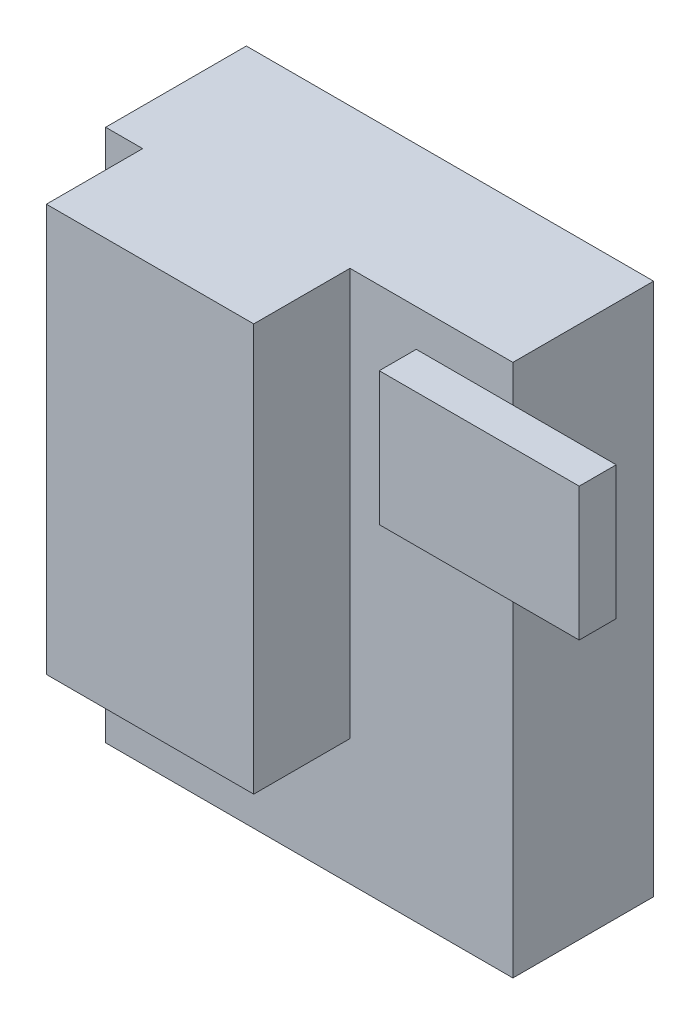
ISO-10303-21;
HEADER;
FILE_DESCRIPTION(('STEP AP214'),'2;1');
FILE_NAME('part.step','',(''),(''),'','','');
FILE_SCHEMA(('AUTOMOTIVE_DESIGN { 1 0 10303 214 1 1 1 1 }'));
ENDSEC;
DATA;
#1=APPLICATION_CONTEXT('core data for automotive mechanical design processes');
#2=APPLICATION_PROTOCOL_DEFINITION('international standard','automotive_design',2000,#1);
#3=PRODUCT_CONTEXT('',#1,'mechanical');
#4=PRODUCT('Part','Part','',(#3));
#5=PRODUCT_RELATED_PRODUCT_CATEGORY('part','',(#4));
#6=PRODUCT_DEFINITION_FORMATION('','',#4);
#7=PRODUCT_DEFINITION_CONTEXT('part definition',#1,'design');
#8=PRODUCT_DEFINITION('design','',#6,#7);
#9=PRODUCT_DEFINITION_SHAPE('','',#8);
#10=(LENGTH_UNIT() NAMED_UNIT(*) SI_UNIT(.MILLI.,.METRE.));
#11=(NAMED_UNIT(*) PLANE_ANGLE_UNIT() SI_UNIT($,.RADIAN.));
#12=(NAMED_UNIT(*) SI_UNIT($,.STERADIAN.) SOLID_ANGLE_UNIT());
#13=UNCERTAINTY_MEASURE_WITH_UNIT(LENGTH_MEASURE(1.E-05),#10,'distance_accuracy_value','');
#14=(GEOMETRIC_REPRESENTATION_CONTEXT(3) GLOBAL_UNCERTAINTY_ASSIGNED_CONTEXT((#13)) GLOBAL_UNIT_ASSIGNED_CONTEXT((#10,
#11,#12)) REPRESENTATION_CONTEXT('',''));
#15=CARTESIAN_POINT('',(0.,0.,0.));
#16=DIRECTION('',(0.,0.,1.));
#17=DIRECTION('',(1.,0.,0.));
#18=AXIS2_PLACEMENT_3D('',#15,#16,#17);
#19=CARTESIAN_POINT('',(0.,0.,19.));
#20=DIRECTION('',(0.,0.,1.));
#21=DIRECTION('',(1.,0.,0.));
#22=AXIS2_PLACEMENT_3D('',#19,#20,#21);
#23=PLANE('',#22);
#24=DIRECTION('',(0.,1.,0.));
#25=VECTOR('',#24,1.);
#26=CARTESIAN_POINT('',(27.7547837249418,20.2890365448505,19.));
#27=LINE('',#26,#25);
#28=CARTESIAN_POINT('',(27.7547837249418,-51.7109634551495,19.));
#29=VERTEX_POINT('',#28);
#30=CARTESIAN_POINT('',(27.7547837249418,-2.7109634551495,19.));
#31=VERTEX_POINT('',#30);
#32=EDGE_CURVE('E194',#29,#31,#27,.T.);
#33=ORIENTED_EDGE('',*,*,#32,.T.);
#34=DIRECTION('',(1.,0.,0.));
#35=VECTOR('',#34,1.);
#36=CARTESIAN_POINT('',(14.7059328797958,-2.7109634551495,19.));
#37=LINE('',#36,#35);
#38=CARTESIAN_POINT('',(14.7059328797958,-2.7109634551495,19.));
#39=VERTEX_POINT('',#38);
#40=EDGE_CURVE('E48',#39,#31,#37,.T.);
#41=ORIENTED_EDGE('',*,*,#40,.F.);
#42=DIRECTION('',(0.,-1.,0.));
#43=VECTOR('',#42,1.);
#44=CARTESIAN_POINT('',(14.7059328797958,15.2890365448505,19.));
#45=LINE('',#44,#43);
#46=CARTESIAN_POINT('',(14.7059328797958,15.2890365448505,19.));
#47=VERTEX_POINT('',#46);
#48=EDGE_CURVE('E150',#47,#39,#45,.T.);
#49=ORIENTED_EDGE('',*,*,#48,.F.);
#50=DIRECTION('',(1.,0.,0.));
#51=VECTOR('',#50,1.);
#52=CARTESIAN_POINT('',(14.7059328797958,15.2890365448505,19.));
#53=LINE('',#52,#51);
#54=CARTESIAN_POINT('',(27.7547837249418,15.2890365448505,19.));
#55=VERTEX_POINT('',#54);
#56=EDGE_CURVE('E54',#47,#55,#53,.T.);
#57=ORIENTED_EDGE('',*,*,#56,.T.);
#58=CARTESIAN_POINT('',(27.7547837249418,20.2890365448505,19.));
#59=VERTEX_POINT('',#58);
#60=EDGE_CURVE('E193',#55,#59,#27,.T.);
#61=ORIENTED_EDGE('',*,*,#60,.T.);
#62=DIRECTION('',(-1.,0.,0.));
#63=VECTOR('',#62,1.);
#64=CARTESIAN_POINT('',(-27.2452162750582,20.2890365448505,19.));
#65=LINE('',#64,#63);
#66=CARTESIAN_POINT('',(5.75478372494178,20.2890365448505,19.));
#67=VERTEX_POINT('',#66);
#68=EDGE_CURVE('E198',#59,#67,#65,.T.);
#69=ORIENTED_EDGE('',*,*,#68,.T.);
#70=DIRECTION('',(0.,1.,0.));
#71=VECTOR('',#70,1.);
#72=CARTESIAN_POINT('',(5.75478372494178,20.2890365448505,19.));
#73=LINE('',#72,#71);
#74=CARTESIAN_POINT('',(5.75478372494178,-34.7109634551495,19.));
#75=VERTEX_POINT('',#74);
#76=EDGE_CURVE('E164',#75,#67,#73,.T.);
#77=ORIENTED_EDGE('',*,*,#76,.F.);
#78=DIRECTION('',(1.,0.,0.));
#79=VECTOR('',#78,1.);
#80=CARTESIAN_POINT('',(-22.2452162750582,-34.7109634551495,19.));
#81=LINE('',#80,#79);
#82=CARTESIAN_POINT('',(-22.2452162750582,-34.7109634551495,19.));
#83=VERTEX_POINT('',#82);
#84=EDGE_CURVE('E154',#83,#75,#81,.T.);
#85=ORIENTED_EDGE('',*,*,#84,.F.);
#86=DIRECTION('',(0.,-1.,0.));
#87=VECTOR('',#86,1.);
#88=CARTESIAN_POINT('',(-22.2452162750582,20.2890365448505,19.));
#89=LINE('',#88,#87);
#90=CARTESIAN_POINT('',(-22.2452162750582,20.2890365448505,19.));
#91=VERTEX_POINT('',#90);
#92=EDGE_CURVE('E151',#91,#83,#89,.T.);
#93=ORIENTED_EDGE('',*,*,#92,.F.);
#94=CARTESIAN_POINT('',(-27.2452162750582,20.2890365448505,19.));
#95=VERTEX_POINT('',#94);
#96=EDGE_CURVE('E196',#91,#95,#65,.T.);
#97=ORIENTED_EDGE('',*,*,#96,.T.);
#98=DIRECTION('',(0.,-1.,0.));
#99=VECTOR('',#98,1.);
#100=CARTESIAN_POINT('',(-27.2452162750582,20.2890365448505,19.));
#101=LINE('',#100,#99);
#102=CARTESIAN_POINT('',(-27.2452162750582,-51.7109634551495,19.));
#103=VERTEX_POINT('',#102);
#104=EDGE_CURVE('E187',#95,#103,#101,.T.);
#105=ORIENTED_EDGE('',*,*,#104,.T.);
#106=DIRECTION('',(1.,0.,0.));
#107=VECTOR('',#106,1.);
#108=CARTESIAN_POINT('',(-27.2452162750582,-51.7109634551495,19.));
#109=LINE('',#108,#107);
#110=EDGE_CURVE('E190',#103,#29,#109,.T.);
#111=ORIENTED_EDGE('',*,*,#110,.T.);
#112=EDGE_LOOP('',(#33,#41,#49,#57,#61,#69,#77,#85,#93,#97,#105,#111));
#113=FACE_BOUND('',#112,.T.);
#114=ADVANCED_FACE('F33',(#113),#23,.T.);
#115=CARTESIAN_POINT('',(-27.2452162750582,20.2890365448505,19.));
#116=DIRECTION('',(1.,0.,0.));
#117=DIRECTION('',(0.,1.,0.));
#118=AXIS2_PLACEMENT_3D('',#115,#116,#117);
#119=PLANE('',#118);
#120=DIRECTION('',(0.,-1.,0.));
#121=VECTOR('',#120,1.);
#122=CARTESIAN_POINT('',(-27.2452162750582,20.2890365448505,0.));
#123=LINE('',#122,#121);
#124=CARTESIAN_POINT('',(-27.2452162750582,20.2890365448505,0.));
#125=VERTEX_POINT('',#124);
#126=CARTESIAN_POINT('',(-27.2452162750582,-51.7109634551495,0.));
#127=VERTEX_POINT('',#126);
#128=EDGE_CURVE('E186',#125,#127,#123,.T.);
#129=ORIENTED_EDGE('',*,*,#128,.T.);
#130=DIRECTION('',(0.,0.,-1.));
#131=VECTOR('',#130,1.);
#132=CARTESIAN_POINT('',(-27.2452162750582,-51.7109634551495,19.));
#133=LINE('',#132,#131);
#134=EDGE_CURVE('E11',#103,#127,#133,.T.);
#135=ORIENTED_EDGE('',*,*,#134,.F.);
#136=ORIENTED_EDGE('',*,*,#104,.F.);
#137=DIRECTION('',(0.,0.,-1.));
#138=VECTOR('',#137,1.);
#139=CARTESIAN_POINT('',(-27.2452162750582,20.2890365448505,19.));
#140=LINE('',#139,#138);
#141=EDGE_CURVE('E200',#95,#125,#140,.T.);
#142=ORIENTED_EDGE('',*,*,#141,.T.);
#143=EDGE_LOOP('',(#129,#135,#136,#142));
#144=FACE_BOUND('',#143,.T.);
#145=ADVANCED_FACE('F35',(#144),#119,.F.);
#146=CARTESIAN_POINT('',(-27.2452162750582,-51.7109634551495,19.));
#147=DIRECTION('',(0.,1.,0.));
#148=DIRECTION('',(0.,0.,1.));
#149=AXIS2_PLACEMENT_3D('',#146,#147,#148);
#150=PLANE('',#149);
#151=DIRECTION('',(1.,0.,0.));
#152=VECTOR('',#151,1.);
#153=CARTESIAN_POINT('',(-27.2452162750582,-51.7109634551495,0.));
#154=LINE('',#153,#152);
#155=CARTESIAN_POINT('',(27.7547837249418,-51.7109634551495,0.));
#156=VERTEX_POINT('',#155);
#157=EDGE_CURVE('E203',#127,#156,#154,.T.);
#158=ORIENTED_EDGE('',*,*,#157,.T.);
#159=DIRECTION('',(0.,0.,-1.));
#160=VECTOR('',#159,1.);
#161=CARTESIAN_POINT('',(27.7547837249418,-51.7109634551495,19.));
#162=LINE('',#161,#160);
#163=EDGE_CURVE('E41',#29,#156,#162,.T.);
#164=ORIENTED_EDGE('',*,*,#163,.F.);
#165=ORIENTED_EDGE('',*,*,#110,.F.);
#166=ORIENTED_EDGE('',*,*,#134,.T.);
#167=EDGE_LOOP('',(#158,#164,#165,#166));
#168=FACE_BOUND('',#167,.T.);
#169=ADVANCED_FACE('F260',(#168),#150,.F.);
#170=CARTESIAN_POINT('',(27.7547837249418,20.2890365448505,19.));
#171=DIRECTION('',(-1.,0.,0.));
#172=DIRECTION('',(0.,-1.,0.));
#173=AXIS2_PLACEMENT_3D('',#170,#171,#172);
#174=PLANE('',#173);
#175=DIRECTION('',(0.,1.,0.));
#176=VECTOR('',#175,1.);
#177=CARTESIAN_POINT('',(27.7547837249418,20.2890365448505,0.));
#178=LINE('',#177,#176);
#179=CARTESIAN_POINT('',(27.7547837249418,20.2890365448505,0.));
#180=VERTEX_POINT('',#179);
#181=EDGE_CURVE('E205',#156,#180,#178,.T.);
#182=ORIENTED_EDGE('',*,*,#181,.T.);
#183=DIRECTION('',(0.,0.,-1.));
#184=VECTOR('',#183,1.);
#185=CARTESIAN_POINT('',(27.7547837249418,20.2890365448505,19.));
#186=LINE('',#185,#184);
#187=EDGE_CURVE('E210',#59,#180,#186,.T.);
#188=ORIENTED_EDGE('',*,*,#187,.F.);
#189=ORIENTED_EDGE('',*,*,#60,.F.);
#190=EDGE_CURVE('E197',#31,#55,#27,.T.);
#191=ORIENTED_EDGE('',*,*,#190,.F.);
#192=ORIENTED_EDGE('',*,*,#32,.F.);
#193=ORIENTED_EDGE('',*,*,#163,.T.);
#194=EDGE_LOOP('',(#182,#188,#189,#191,#192,#193));
#195=FACE_BOUND('',#194,.T.);
#196=ADVANCED_FACE('F217',(#195),#174,.F.);
#197=CARTESIAN_POINT('',(-27.2452162750582,20.2890365448505,19.));
#198=DIRECTION('',(0.,-1.,0.));
#199=DIRECTION('',(0.,0.,-1.));
#200=AXIS2_PLACEMENT_3D('',#197,#198,#199);
#201=PLANE('',#200);
#202=DIRECTION('',(-1.,0.,0.));
#203=VECTOR('',#202,1.);
#204=CARTESIAN_POINT('',(-27.2452162750582,20.2890365448505,0.));
#205=LINE('',#204,#203);
#206=EDGE_CURVE('E191',#180,#125,#205,.T.);
#207=ORIENTED_EDGE('',*,*,#206,.T.);
#208=ORIENTED_EDGE('',*,*,#141,.F.);
#209=ORIENTED_EDGE('',*,*,#96,.F.);
#210=DIRECTION('',(0.,0.,-1.));
#211=VECTOR('',#210,1.);
#212=CARTESIAN_POINT('',(-22.2452162750582,20.2890365448505,32.));
#213=LINE('',#212,#211);
#214=CARTESIAN_POINT('',(-22.2452162750582,20.2890365448505,32.));
#215=VERTEX_POINT('',#214);
#216=EDGE_CURVE('E169',#215,#91,#213,.T.);
#217=ORIENTED_EDGE('',*,*,#216,.F.);
#218=DIRECTION('',(-1.,0.,0.));
#219=VECTOR('',#218,1.);
#220=CARTESIAN_POINT('',(-22.2452162750582,20.2890365448505,32.));
#221=LINE('',#220,#219);
#222=CARTESIAN_POINT('',(5.75478372494178,20.2890365448505,32.));
#223=VERTEX_POINT('',#222);
#224=EDGE_CURVE('E168',#223,#215,#221,.T.);
#225=ORIENTED_EDGE('',*,*,#224,.F.);
#226=DIRECTION('',(0.,0.,-1.));
#227=VECTOR('',#226,1.);
#228=CARTESIAN_POINT('',(5.75478372494178,20.2890365448505,32.));
#229=LINE('',#228,#227);
#230=EDGE_CURVE('E177',#223,#67,#229,.T.);
#231=ORIENTED_EDGE('',*,*,#230,.T.);
#232=ORIENTED_EDGE('',*,*,#68,.F.);
#233=ORIENTED_EDGE('',*,*,#187,.T.);
#234=EDGE_LOOP('',(#207,#208,#209,#217,#225,#231,#232,#233));
#235=FACE_BOUND('',#234,.T.);
#236=ADVANCED_FACE('F226',(#235),#201,.F.);
#237=CARTESIAN_POINT('',(0.,0.,0.));
#238=DIRECTION('',(0.,0.,1.));
#239=DIRECTION('',(1.,0.,0.));
#240=AXIS2_PLACEMENT_3D('',#237,#238,#239);
#241=PLANE('',#240);
#242=ORIENTED_EDGE('',*,*,#128,.F.);
#243=ORIENTED_EDGE('',*,*,#206,.F.);
#244=ORIENTED_EDGE('',*,*,#181,.F.);
#245=ORIENTED_EDGE('',*,*,#157,.F.);
#246=EDGE_LOOP('',(#242,#243,#244,#245));
#247=FACE_BOUND('',#246,.T.);
#248=ADVANCED_FACE('F223',(#247),#241,.F.);
#249=CARTESIAN_POINT('',(-22.2452162750582,20.2890365448505,32.));
#250=DIRECTION('',(1.,0.,0.));
#251=DIRECTION('',(0.,1.,0.));
#252=AXIS2_PLACEMENT_3D('',#249,#250,#251);
#253=PLANE('',#252);
#254=ORIENTED_EDGE('',*,*,#92,.T.);
#255=DIRECTION('',(0.,0.,-1.));
#256=VECTOR('',#255,1.);
#257=CARTESIAN_POINT('',(-22.2452162750582,-34.7109634551495,32.));
#258=LINE('',#257,#256);
#259=CARTESIAN_POINT('',(-22.2452162750582,-34.7109634551495,32.));
#260=VERTEX_POINT('',#259);
#261=EDGE_CURVE('E183',#260,#83,#258,.T.);
#262=ORIENTED_EDGE('',*,*,#261,.F.);
#263=DIRECTION('',(0.,-1.,0.));
#264=VECTOR('',#263,1.);
#265=CARTESIAN_POINT('',(-22.2452162750582,20.2890365448505,32.));
#266=LINE('',#265,#264);
#267=EDGE_CURVE('E160',#215,#260,#266,.T.);
#268=ORIENTED_EDGE('',*,*,#267,.F.);
#269=ORIENTED_EDGE('',*,*,#216,.T.);
#270=EDGE_LOOP('',(#254,#262,#268,#269));
#271=FACE_BOUND('',#270,.T.);
#272=ADVANCED_FACE('F236',(#271),#253,.F.);
#273=CARTESIAN_POINT('',(-22.2452162750582,-34.7109634551495,32.));
#274=DIRECTION('',(0.,1.,0.));
#275=DIRECTION('',(0.,0.,1.));
#276=AXIS2_PLACEMENT_3D('',#273,#274,#275);
#277=PLANE('',#276);
#278=ORIENTED_EDGE('',*,*,#84,.T.);
#279=DIRECTION('',(0.,0.,-1.));
#280=VECTOR('',#279,1.);
#281=CARTESIAN_POINT('',(5.75478372494178,-34.7109634551495,32.));
#282=LINE('',#281,#280);
#283=CARTESIAN_POINT('',(5.75478372494178,-34.7109634551495,32.));
#284=VERTEX_POINT('',#283);
#285=EDGE_CURVE('E180',#284,#75,#282,.T.);
#286=ORIENTED_EDGE('',*,*,#285,.F.);
#287=DIRECTION('',(1.,0.,0.));
#288=VECTOR('',#287,1.);
#289=CARTESIAN_POINT('',(-22.2452162750582,-34.7109634551495,32.));
#290=LINE('',#289,#288);
#291=EDGE_CURVE('E163',#260,#284,#290,.T.);
#292=ORIENTED_EDGE('',*,*,#291,.F.);
#293=ORIENTED_EDGE('',*,*,#261,.T.);
#294=EDGE_LOOP('',(#278,#286,#292,#293));
#295=FACE_BOUND('',#294,.T.);
#296=ADVANCED_FACE('F246',(#295),#277,.F.);
#297=CARTESIAN_POINT('',(5.75478372494178,20.2890365448505,32.));
#298=DIRECTION('',(-1.,0.,0.));
#299=DIRECTION('',(0.,-1.,0.));
#300=AXIS2_PLACEMENT_3D('',#297,#298,#299);
#301=PLANE('',#300);
#302=ORIENTED_EDGE('',*,*,#76,.T.);
#303=ORIENTED_EDGE('',*,*,#230,.F.);
#304=DIRECTION('',(0.,1.,0.));
#305=VECTOR('',#304,1.);
#306=CARTESIAN_POINT('',(5.75478372494178,20.2890365448505,32.));
#307=LINE('',#306,#305);
#308=EDGE_CURVE('E166',#284,#223,#307,.T.);
#309=ORIENTED_EDGE('',*,*,#308,.F.);
#310=ORIENTED_EDGE('',*,*,#285,.T.);
#311=EDGE_LOOP('',(#302,#303,#309,#310));
#312=FACE_BOUND('',#311,.T.);
#313=ADVANCED_FACE('F244',(#312),#301,.F.);
#314=CARTESIAN_POINT('',(0.,0.,32.));
#315=DIRECTION('',(0.,0.,1.));
#316=DIRECTION('',(1.,0.,0.));
#317=AXIS2_PLACEMENT_3D('',#314,#315,#316);
#318=PLANE('',#317);
#319=ORIENTED_EDGE('',*,*,#267,.T.);
#320=ORIENTED_EDGE('',*,*,#291,.T.);
#321=ORIENTED_EDGE('',*,*,#308,.T.);
#322=ORIENTED_EDGE('',*,*,#224,.T.);
#323=EDGE_LOOP('',(#319,#320,#321,#322));
#324=FACE_BOUND('',#323,.T.);
#325=ADVANCED_FACE('F239',(#324),#318,.T.);
#326=CARTESIAN_POINT('',(0.,0.,19.));
#327=DIRECTION('',(0.,0.,1.));
#328=DIRECTION('',(1.,0.,0.));
#329=AXIS2_PLACEMENT_3D('',#326,#327,#328);
#330=PLANE('',#329);
#331=CARTESIAN_POINT('',(41.7059328797958,-2.7109634551495,19.));
#332=VERTEX_POINT('',#331);
#333=EDGE_CURVE('E380',#31,#332,#37,.T.);
#334=ORIENTED_EDGE('',*,*,#333,.F.);
#335=ORIENTED_EDGE('',*,*,#190,.T.);
#336=CARTESIAN_POINT('',(41.7059328797958,15.2890365448505,19.));
#337=VERTEX_POINT('',#336);
#338=EDGE_CURVE('E371',#55,#337,#53,.T.);
#339=ORIENTED_EDGE('',*,*,#338,.T.);
#340=DIRECTION('',(0.,-1.,0.));
#341=VECTOR('',#340,1.);
#342=CARTESIAN_POINT('',(41.7059328797958,15.2890365448505,19.));
#343=LINE('',#342,#341);
#344=EDGE_CURVE('E373',#337,#332,#343,.T.);
#345=ORIENTED_EDGE('',*,*,#344,.T.);
#346=EDGE_LOOP('',(#334,#335,#339,#345));
#347=FACE_BOUND('',#346,.T.);
#348=ADVANCED_FACE('F307',(#347),#330,.F.);
#349=CARTESIAN_POINT('',(14.7059328797958,15.2890365448505,24.));
#350=DIRECTION('',(1.,0.,0.));
#351=DIRECTION('',(0.,1.,0.));
#352=AXIS2_PLACEMENT_3D('',#349,#350,#351);
#353=PLANE('',#352);
#354=ORIENTED_EDGE('',*,*,#48,.T.);
#355=DIRECTION('',(0.,0.,-1.));
#356=VECTOR('',#355,1.);
#357=CARTESIAN_POINT('',(14.7059328797958,-2.7109634551495,24.));
#358=LINE('',#357,#356);
#359=CARTESIAN_POINT('',(14.7059328797958,-2.7109634551495,24.));
#360=VERTEX_POINT('',#359);
#361=EDGE_CURVE('E131',#360,#39,#358,.T.);
#362=ORIENTED_EDGE('',*,*,#361,.F.);
#363=DIRECTION('',(0.,-1.,0.));
#364=VECTOR('',#363,1.);
#365=CARTESIAN_POINT('',(14.7059328797958,15.2890365448505,24.));
#366=LINE('',#365,#364);
#367=CARTESIAN_POINT('',(14.7059328797958,15.2890365448505,24.));
#368=VERTEX_POINT('',#367);
#369=EDGE_CURVE('E139',#368,#360,#366,.T.);
#370=ORIENTED_EDGE('',*,*,#369,.F.);
#371=DIRECTION('',(0.,0.,-1.));
#372=VECTOR('',#371,1.);
#373=CARTESIAN_POINT('',(14.7059328797958,15.2890365448505,24.));
#374=LINE('',#373,#372);
#375=EDGE_CURVE('E369',#368,#47,#374,.T.);
#376=ORIENTED_EDGE('',*,*,#375,.T.);
#377=EDGE_LOOP('',(#354,#362,#370,#376));
#378=FACE_BOUND('',#377,.T.);
#379=ADVANCED_FACE('F149',(#378),#353,.F.);
#380=CARTESIAN_POINT('',(14.7059328797958,-2.7109634551495,24.));
#381=DIRECTION('',(0.,1.,0.));
#382=DIRECTION('',(0.,0.,1.));
#383=AXIS2_PLACEMENT_3D('',#380,#381,#382);
#384=PLANE('',#383);
#385=ORIENTED_EDGE('',*,*,#40,.T.);
#386=ORIENTED_EDGE('',*,*,#333,.T.);
#387=DIRECTION('',(0.,0.,-1.));
#388=VECTOR('',#387,1.);
#389=CARTESIAN_POINT('',(41.7059328797958,-2.7109634551495,24.));
#390=LINE('',#389,#388);
#391=CARTESIAN_POINT('',(41.7059328797958,-2.7109634551495,24.));
#392=VERTEX_POINT('',#391);
#393=EDGE_CURVE('E134',#392,#332,#390,.T.);
#394=ORIENTED_EDGE('',*,*,#393,.F.);
#395=DIRECTION('',(1.,0.,0.));
#396=VECTOR('',#395,1.);
#397=CARTESIAN_POINT('',(14.7059328797958,-2.7109634551495,24.));
#398=LINE('',#397,#396);
#399=EDGE_CURVE('E127',#360,#392,#398,.T.);
#400=ORIENTED_EDGE('',*,*,#399,.F.);
#401=ORIENTED_EDGE('',*,*,#361,.T.);
#402=EDGE_LOOP('',(#385,#386,#394,#400,#401));
#403=FACE_BOUND('',#402,.T.);
#404=ADVANCED_FACE('F129',(#403),#384,.F.);
#405=CARTESIAN_POINT('',(41.7059328797958,15.2890365448505,24.));
#406=DIRECTION('',(1.,0.,0.));
#407=DIRECTION('',(0.,0.,-1.));
#408=AXIS2_PLACEMENT_3D('',#405,#406,#407);
#409=PLANE('',#408);
#410=ORIENTED_EDGE('',*,*,#344,.F.);
#411=DIRECTION('',(0.,0.,-1.));
#412=VECTOR('',#411,1.);
#413=CARTESIAN_POINT('',(41.7059328797958,15.2890365448505,24.));
#414=LINE('',#413,#412);
#415=CARTESIAN_POINT('',(41.7059328797958,15.2890365448505,24.));
#416=VERTEX_POINT('',#415);
#417=EDGE_CURVE('E156',#416,#337,#414,.T.);
#418=ORIENTED_EDGE('',*,*,#417,.F.);
#419=DIRECTION('',(0.,-1.,0.));
#420=VECTOR('',#419,1.);
#421=CARTESIAN_POINT('',(41.7059328797958,15.2890365448505,24.));
#422=LINE('',#421,#420);
#423=EDGE_CURVE('E138',#416,#392,#422,.T.);
#424=ORIENTED_EDGE('',*,*,#423,.T.);
#425=ORIENTED_EDGE('',*,*,#393,.T.);
#426=EDGE_LOOP('',(#410,#418,#424,#425));
#427=FACE_BOUND('',#426,.T.);
#428=ADVANCED_FACE('F336',(#427),#409,.T.);
#429=CARTESIAN_POINT('',(14.7059328797958,15.2890365448505,24.));
#430=DIRECTION('',(0.,1.,0.));
#431=DIRECTION('',(0.,0.,1.));
#432=AXIS2_PLACEMENT_3D('',#429,#430,#431);
#433=PLANE('',#432);
#434=ORIENTED_EDGE('',*,*,#56,.F.);
#435=ORIENTED_EDGE('',*,*,#375,.F.);
#436=DIRECTION('',(1.,0.,0.));
#437=VECTOR('',#436,1.);
#438=CARTESIAN_POINT('',(14.7059328797958,15.2890365448505,24.));
#439=LINE('',#438,#437);
#440=EDGE_CURVE('E145',#368,#416,#439,.T.);
#441=ORIENTED_EDGE('',*,*,#440,.T.);
#442=ORIENTED_EDGE('',*,*,#417,.T.);
#443=ORIENTED_EDGE('',*,*,#338,.F.);
#444=EDGE_LOOP('',(#434,#435,#441,#442,#443));
#445=FACE_BOUND('',#444,.T.);
#446=ADVANCED_FACE('F344',(#445),#433,.T.);
#447=CARTESIAN_POINT('',(0.,0.,24.));
#448=DIRECTION('',(0.,0.,1.));
#449=DIRECTION('',(1.,0.,0.));
#450=AXIS2_PLACEMENT_3D('',#447,#448,#449);
#451=PLANE('',#450);
#452=ORIENTED_EDGE('',*,*,#369,.T.);
#453=ORIENTED_EDGE('',*,*,#399,.T.);
#454=ORIENTED_EDGE('',*,*,#423,.F.);
#455=ORIENTED_EDGE('',*,*,#440,.F.);
#456=EDGE_LOOP('',(#452,#453,#454,#455));
#457=FACE_BOUND('',#456,.T.);
#458=ADVANCED_FACE('F143',(#457),#451,.T.);
#459=CLOSED_SHELL('',(#114,#145,#169,#196,#236,#248,#272,#296,#313,#325,#348,#379,#404,#428,
#446,#458));
#460=MANIFOLD_SOLID_BREP('B2',#459);
#461=ADVANCED_BREP_SHAPE_REPRESENTATION('',(#18,#460),#14);
#462=SHAPE_DEFINITION_REPRESENTATION(#9,#461);
ENDSEC;
END-ISO-10303-21;
